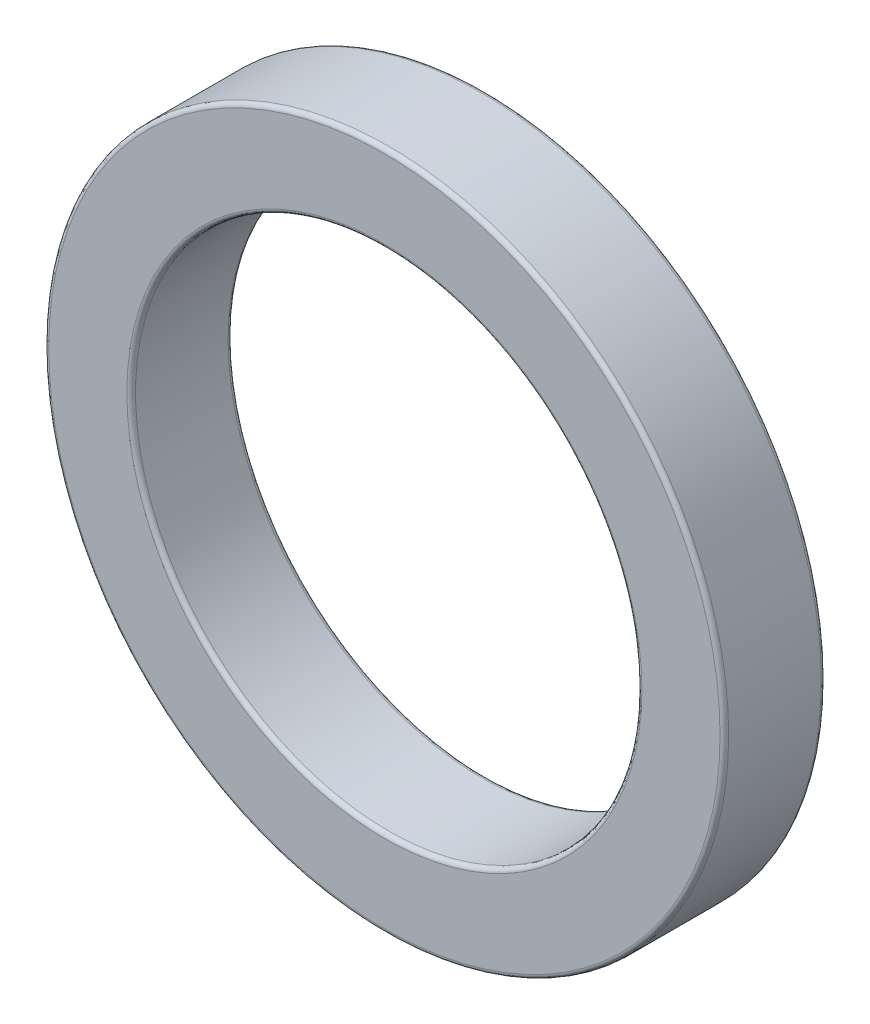
ISO-10303-21;
HEADER;
FILE_DESCRIPTION(('STEP AP214'),'2;1');
FILE_NAME('part.step','',(''),(''),'','','');
FILE_SCHEMA(('AUTOMOTIVE_DESIGN { 1 0 10303 214 1 1 1 1 }'));
ENDSEC;
DATA;
#1=APPLICATION_CONTEXT('core data for automotive mechanical design processes');
#2=APPLICATION_PROTOCOL_DEFINITION('international standard','automotive_design',2000,#1);
#3=PRODUCT_CONTEXT('',#1,'mechanical');
#4=PRODUCT('Part','Part','',(#3));
#5=PRODUCT_RELATED_PRODUCT_CATEGORY('part','',(#4));
#6=PRODUCT_DEFINITION_FORMATION('','',#4);
#7=PRODUCT_DEFINITION_CONTEXT('part definition',#1,'design');
#8=PRODUCT_DEFINITION('design','',#6,#7);
#9=PRODUCT_DEFINITION_SHAPE('','',#8);
#10=(LENGTH_UNIT() NAMED_UNIT(*) SI_UNIT(.MILLI.,.METRE.));
#11=(NAMED_UNIT(*) PLANE_ANGLE_UNIT() SI_UNIT($,.RADIAN.));
#12=(NAMED_UNIT(*) SI_UNIT($,.STERADIAN.) SOLID_ANGLE_UNIT());
#13=UNCERTAINTY_MEASURE_WITH_UNIT(LENGTH_MEASURE(1.E-05),#10,'distance_accuracy_value','');
#14=(GEOMETRIC_REPRESENTATION_CONTEXT(3) GLOBAL_UNCERTAINTY_ASSIGNED_CONTEXT((#13)) GLOBAL_UNIT_ASSIGNED_CONTEXT((#10,
#11,#12)) REPRESENTATION_CONTEXT('',''));
#15=CARTESIAN_POINT('',(0.,0.,0.));
#16=DIRECTION('',(0.,0.,1.));
#17=DIRECTION('',(1.,0.,0.));
#18=AXIS2_PLACEMENT_3D('',#15,#16,#17);
#19=CARTESIAN_POINT('',(23.5,0.,0.3));
#20=CARTESIAN_POINT('',(23.5,0.,0.124264068711928));
#21=CARTESIAN_POINT('',(23.3757359312881,0.,0.));
#22=CARTESIAN_POINT('',(23.2,0.,0.));
#23=(BOUNDED_CURVE() B_SPLINE_CURVE(3,(#19,#20,#21,#22),.UNSPECIFIED.,.F.,
.F.) B_SPLINE_CURVE_WITH_KNOTS((4,4),(0.,1.),
.UNSPECIFIED.) CURVE() GEOMETRIC_REPRESENTATION_ITEM() RATIONAL_B_SPLINE_CURVE((1.,
0.804737854124365,0.804737854124365,1.)) REPRESENTATION_ITEM(''));
#24=CARTESIAN_POINT('',(0.,0.,0.3));
#25=DIRECTION('',(0.,0.,1.));
#26=AXIS1_PLACEMENT('',#24,#25);
#27=SURFACE_OF_REVOLUTION('',#23,#26);
#28=CARTESIAN_POINT('',(0.,0.,0.3));
#29=DIRECTION('',(0.,0.,-1.));
#30=DIRECTION('',(-1.,0.,0.));
#31=AXIS2_PLACEMENT_3D('',#28,#29,#30);
#32=CIRCLE('',#31,23.5);
#33=CARTESIAN_POINT('',(-23.5,0.,0.3));
#34=VERTEX_POINT('',#33);
#35=EDGE_CURVE('E67',#34,#34,#32,.F.);
#36=ORIENTED_EDGE('',*,*,#35,.F.);
#37=EDGE_LOOP('',(#36));
#38=FACE_BOUND('',#37,.T.);
#39=CARTESIAN_POINT('',(0.,0.,0.));
#40=DIRECTION('',(0.,0.,1.));
#41=DIRECTION('',(1.,0.,0.));
#42=AXIS2_PLACEMENT_3D('',#39,#40,#41);
#43=CIRCLE('',#42,23.2);
#44=CARTESIAN_POINT('',(-23.2,0.,0.));
#45=VERTEX_POINT('',#44);
#46=CARTESIAN_POINT('',(23.2,0.,0.));
#47=VERTEX_POINT('',#46);
#48=EDGE_CURVE('E59',#45,#47,#43,.F.);
#49=ORIENTED_EDGE('',*,*,#48,.F.);
#50=CARTESIAN_POINT('',(0.,0.,0.));
#51=DIRECTION('',(0.,0.,1.));
#52=DIRECTION('',(-1.,0.,0.));
#53=AXIS2_PLACEMENT_3D('',#50,#51,#52);
#54=CIRCLE('',#53,23.2);
#55=EDGE_CURVE('E57',#47,#45,#54,.F.);
#56=ORIENTED_EDGE('',*,*,#55,.F.);
#57=EDGE_LOOP('',(#49,#56));
#58=FACE_BOUND('',#57,.T.);
#59=ADVANCED_FACE('F16',(#38,#58),#27,.F.);
#60=CARTESIAN_POINT('',(0.,0.,0.3));
#61=DIRECTION('',(0.,0.,-1.));
#62=DIRECTION('',(-1.,0.,0.));
#63=AXIS2_PLACEMENT_3D('',#60,#61,#62);
#64=CYLINDRICAL_SURFACE('',#63,23.5);
#65=CARTESIAN_POINT('',(0.,0.,6.7));
#66=DIRECTION('',(0.,0.,1.));
#67=DIRECTION('',(1.,0.,0.));
#68=AXIS2_PLACEMENT_3D('',#65,#66,#67);
#69=CIRCLE('',#68,23.5);
#70=CARTESIAN_POINT('',(23.5,0.,6.7));
#71=VERTEX_POINT('',#70);
#72=EDGE_CURVE('E297',#71,#71,#69,.T.);
#73=ORIENTED_EDGE('',*,*,#72,.F.);
#74=EDGE_LOOP('',(#73));
#75=FACE_BOUND('',#74,.T.);
#76=ORIENTED_EDGE('',*,*,#35,.T.);
#77=EDGE_LOOP('',(#76));
#78=FACE_BOUND('',#77,.T.);
#79=ADVANCED_FACE('F86',(#75,#78),#64,.T.);
#80=CARTESIAN_POINT('',(0.,0.,0.));
#81=DIRECTION('',(0.,0.,1.));
#82=DIRECTION('',(1.,0.,0.));
#83=AXIS2_PLACEMENT_3D('',#80,#81,#82);
#84=PLANE('',#83);
#85=CARTESIAN_POINT('',(0.,0.,0.));
#86=DIRECTION('',(0.,0.,-1.));
#87=DIRECTION('',(-1.,0.,0.));
#88=AXIS2_PLACEMENT_3D('',#85,#86,#87);
#89=CIRCLE('',#88,17.8);
#90=CARTESIAN_POINT('',(-17.8,0.,0.));
#91=VERTEX_POINT('',#90);
#92=CARTESIAN_POINT('',(17.8,0.,0.));
#93=VERTEX_POINT('',#92);
#94=EDGE_CURVE('E119',#91,#93,#89,.T.);
#95=ORIENTED_EDGE('',*,*,#94,.F.);
#96=CARTESIAN_POINT('',(0.,0.,0.));
#97=DIRECTION('',(0.,0.,-1.));
#98=DIRECTION('',(1.,0.,0.));
#99=AXIS2_PLACEMENT_3D('',#96,#97,#98);
#100=CIRCLE('',#99,17.8);
#101=EDGE_CURVE('E63',#91,#93,#100,.F.);
#102=ORIENTED_EDGE('',*,*,#101,.T.);
#103=EDGE_LOOP('',(#95,#102));
#104=FACE_BOUND('',#103,.T.);
#105=ORIENTED_EDGE('',*,*,#55,.T.);
#106=ORIENTED_EDGE('',*,*,#48,.T.);
#107=EDGE_LOOP('',(#105,#106));
#108=FACE_BOUND('',#107,.T.);
#109=ADVANCED_FACE('F66',(#104,#108),#84,.F.);
#110=CARTESIAN_POINT('',(23.2,0.,7.));
#111=CARTESIAN_POINT('',(23.3757359312881,0.,7.));
#112=CARTESIAN_POINT('',(23.5,0.,6.87573593128807));
#113=CARTESIAN_POINT('',(23.5,0.,6.7));
#114=(BOUNDED_CURVE() B_SPLINE_CURVE(3,(#110,#111,#112,#113),.UNSPECIFIED.,.F.,
.F.) B_SPLINE_CURVE_WITH_KNOTS((4,4),(0.,1.),
.UNSPECIFIED.) CURVE() GEOMETRIC_REPRESENTATION_ITEM() RATIONAL_B_SPLINE_CURVE((1.,
0.804737854124365,0.804737854124365,1.)) REPRESENTATION_ITEM(''));
#115=CARTESIAN_POINT('',(0.,0.,6.7));
#116=DIRECTION('',(0.,0.,1.));
#117=AXIS1_PLACEMENT('',#115,#116);
#118=SURFACE_OF_REVOLUTION('',#114,#117);
#119=ORIENTED_EDGE('',*,*,#72,.T.);
#120=EDGE_LOOP('',(#119));
#121=FACE_BOUND('',#120,.T.);
#122=CARTESIAN_POINT('',(0.,0.,7.));
#123=DIRECTION('',(0.,0.,-1.));
#124=DIRECTION('',(1.,0.,0.));
#125=AXIS2_PLACEMENT_3D('',#122,#123,#124);
#126=CIRCLE('',#125,23.2);
#127=CARTESIAN_POINT('',(-23.2,0.,7.));
#128=VERTEX_POINT('',#127);
#129=CARTESIAN_POINT('',(23.2,0.,7.));
#130=VERTEX_POINT('',#129);
#131=EDGE_CURVE('E157',#128,#130,#126,.F.);
#132=ORIENTED_EDGE('',*,*,#131,.F.);
#133=CARTESIAN_POINT('',(0.,0.,7.));
#134=DIRECTION('',(0.,0.,-1.));
#135=DIRECTION('',(-1.,0.,0.));
#136=AXIS2_PLACEMENT_3D('',#133,#134,#135);
#137=CIRCLE('',#136,23.2);
#138=EDGE_CURVE('E159',#130,#128,#137,.F.);
#139=ORIENTED_EDGE('',*,*,#138,.F.);
#140=EDGE_LOOP('',(#132,#139));
#141=FACE_BOUND('',#140,.T.);
#142=ADVANCED_FACE('F85',(#121,#141),#118,.F.);
#143=CARTESIAN_POINT('',(17.8,0.,0.));
#144=CARTESIAN_POINT('',(17.6242640687119,0.,0.));
#145=CARTESIAN_POINT('',(17.5,0.,0.124264068711925));
#146=CARTESIAN_POINT('',(17.5,0.,0.299999999999997));
#147=(BOUNDED_CURVE() B_SPLINE_CURVE(3,(#143,#144,#145,#146),.UNSPECIFIED.,.F.,
.F.) B_SPLINE_CURVE_WITH_KNOTS((4,4),(0.,1.),
.UNSPECIFIED.) CURVE() GEOMETRIC_REPRESENTATION_ITEM() RATIONAL_B_SPLINE_CURVE((1.,
0.804737854124365,0.804737854124365,1.)) REPRESENTATION_ITEM(''));
#148=CARTESIAN_POINT('',(0.,0.,0.3));
#149=DIRECTION('',(0.,0.,1.));
#150=AXIS1_PLACEMENT('',#148,#149);
#151=SURFACE_OF_REVOLUTION('',#147,#150);
#152=CARTESIAN_POINT('',(0.,0.,0.3));
#153=DIRECTION('',(0.,0.,-1.));
#154=DIRECTION('',(-1.,0.,0.));
#155=AXIS2_PLACEMENT_3D('',#152,#153,#154);
#156=CIRCLE('',#155,17.5);
#157=CARTESIAN_POINT('',(-17.5,0.,0.3));
#158=VERTEX_POINT('',#157);
#159=EDGE_CURVE('E205',#158,#158,#156,.T.);
#160=ORIENTED_EDGE('',*,*,#159,.F.);
#161=EDGE_LOOP('',(#160));
#162=FACE_BOUND('',#161,.T.);
#163=ORIENTED_EDGE('',*,*,#94,.T.);
#164=ORIENTED_EDGE('',*,*,#101,.F.);
#165=EDGE_LOOP('',(#163,#164));
#166=FACE_BOUND('',#165,.T.);
#167=ADVANCED_FACE('F123',(#162,#166),#151,.F.);
#168=CARTESIAN_POINT('',(0.,0.,7.));
#169=DIRECTION('',(0.,0.,1.));
#170=DIRECTION('',(1.,0.,0.));
#171=AXIS2_PLACEMENT_3D('',#168,#169,#170);
#172=PLANE('',#171);
#173=CARTESIAN_POINT('',(0.,0.,6.99999999999999));
#174=DIRECTION('',(0.,0.,1.));
#175=DIRECTION('',(-1.,0.,0.));
#176=AXIS2_PLACEMENT_3D('',#173,#174,#175);
#177=CIRCLE('',#176,17.8);
#178=CARTESIAN_POINT('',(17.8,0.,7.));
#179=VERTEX_POINT('',#178);
#180=CARTESIAN_POINT('',(-17.8,0.,7.));
#181=VERTEX_POINT('',#180);
#182=EDGE_CURVE('E36',#179,#181,#177,.F.);
#183=ORIENTED_EDGE('',*,*,#182,.T.);
#184=CARTESIAN_POINT('',(0.,0.,6.99999999999999));
#185=DIRECTION('',(0.,0.,1.));
#186=DIRECTION('',(1.,0.,0.));
#187=AXIS2_PLACEMENT_3D('',#184,#185,#186);
#188=CIRCLE('',#187,17.8);
#189=EDGE_CURVE('E28',#179,#181,#188,.T.);
#190=ORIENTED_EDGE('',*,*,#189,.F.);
#191=EDGE_LOOP('',(#183,#190));
#192=FACE_BOUND('',#191,.T.);
#193=ORIENTED_EDGE('',*,*,#138,.T.);
#194=ORIENTED_EDGE('',*,*,#131,.T.);
#195=EDGE_LOOP('',(#193,#194));
#196=FACE_BOUND('',#195,.T.);
#197=ADVANCED_FACE('F133',(#192,#196),#172,.T.);
#198=CARTESIAN_POINT('',(0.,0.,6.7));
#199=DIRECTION('',(0.,0.,-1.));
#200=DIRECTION('',(0.,1.,0.));
#201=AXIS2_PLACEMENT_3D('',#198,#199,#200);
#202=CYLINDRICAL_SURFACE('',#201,17.5);
#203=CARTESIAN_POINT('',(0.,0.,6.7));
#204=DIRECTION('',(0.,0.,1.));
#205=DIRECTION('',(1.,0.,0.));
#206=AXIS2_PLACEMENT_3D('',#203,#204,#205);
#207=CIRCLE('',#206,17.5);
#208=CARTESIAN_POINT('',(17.5,0.,6.7));
#209=VERTEX_POINT('',#208);
#210=EDGE_CURVE('E11',#209,#209,#207,.F.);
#211=ORIENTED_EDGE('',*,*,#210,.F.);
#212=EDGE_LOOP('',(#211));
#213=FACE_BOUND('',#212,.T.);
#214=ORIENTED_EDGE('',*,*,#159,.T.);
#215=EDGE_LOOP('',(#214));
#216=FACE_BOUND('',#215,.T.);
#217=ADVANCED_FACE('F225',(#213,#216),#202,.F.);
#218=CARTESIAN_POINT('',(17.5,0.,6.7));
#219=CARTESIAN_POINT('',(17.5,0.,6.87573593128807));
#220=CARTESIAN_POINT('',(17.6242640687119,0.,6.99999999999999));
#221=CARTESIAN_POINT('',(17.8,0.,6.99999999999999));
#222=(BOUNDED_CURVE() B_SPLINE_CURVE(3,(#218,#219,#220,#221),.UNSPECIFIED.,.F.,
.F.) B_SPLINE_CURVE_WITH_KNOTS((4,4),(0.,1.),
.UNSPECIFIED.) CURVE() GEOMETRIC_REPRESENTATION_ITEM() RATIONAL_B_SPLINE_CURVE((1.,
0.804737854124367,0.804737854124367,1.)) REPRESENTATION_ITEM(''));
#223=CARTESIAN_POINT('',(0.,0.,6.7));
#224=DIRECTION('',(0.,0.,1.));
#225=AXIS1_PLACEMENT('',#223,#224);
#226=SURFACE_OF_REVOLUTION('',#222,#225);
#227=ORIENTED_EDGE('',*,*,#189,.T.);
#228=ORIENTED_EDGE('',*,*,#182,.F.);
#229=EDGE_LOOP('',(#227,#228));
#230=FACE_BOUND('',#229,.T.);
#231=ORIENTED_EDGE('',*,*,#210,.T.);
#232=EDGE_LOOP('',(#231));
#233=FACE_BOUND('',#232,.T.);
#234=ADVANCED_FACE('F202',(#230,#233),#226,.F.);
#235=CLOSED_SHELL('',(#59,#79,#109,#142,#167,#197,#217,#234));
#236=MANIFOLD_SOLID_BREP('B1',#235);
#237=ADVANCED_BREP_SHAPE_REPRESENTATION('',(#18,#236),#14);
#238=SHAPE_DEFINITION_REPRESENTATION(#9,#237);
ENDSEC;
END-ISO-10303-21;
